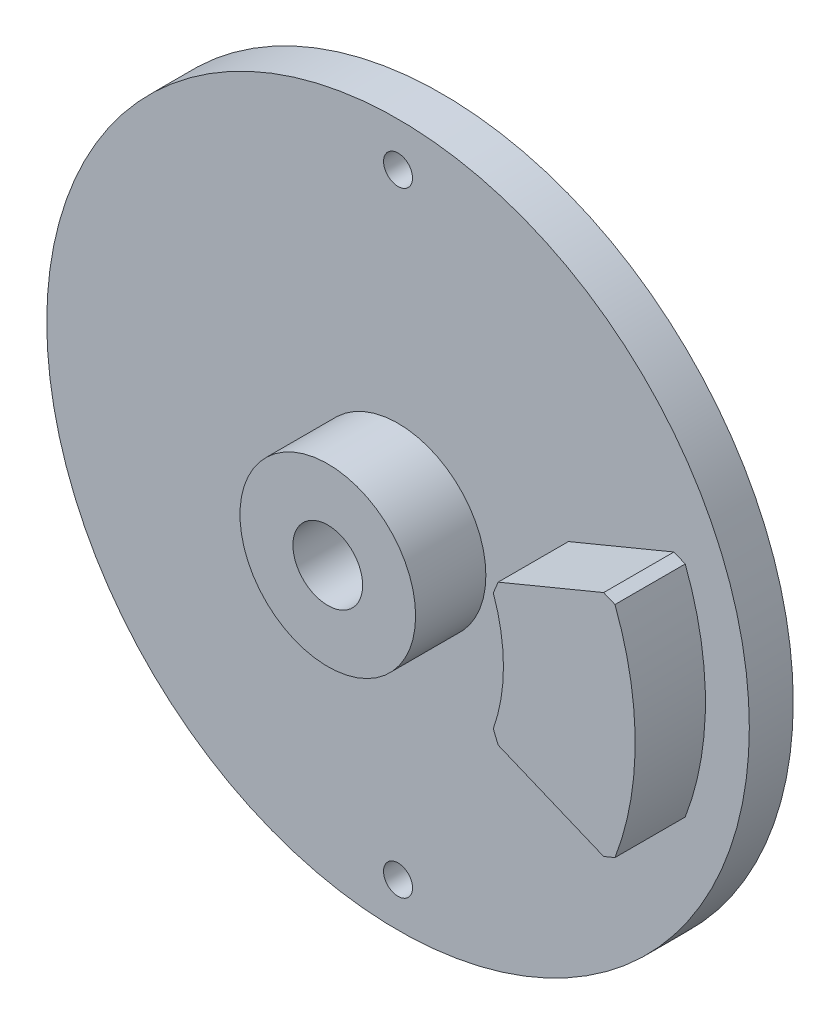
ISO-10303-21;
HEADER;
FILE_DESCRIPTION(('STEP AP214'),'2;1');
FILE_NAME('part.step','',(''),(''),'','','');
FILE_SCHEMA(('AUTOMOTIVE_DESIGN { 1 0 10303 214 1 1 1 1 }'));
ENDSEC;
DATA;
#1=APPLICATION_CONTEXT('core data for automotive mechanical design processes');
#2=APPLICATION_PROTOCOL_DEFINITION('international standard','automotive_design',2000,#1);
#3=PRODUCT_CONTEXT('',#1,'mechanical');
#4=PRODUCT('Part','Part','',(#3));
#5=PRODUCT_RELATED_PRODUCT_CATEGORY('part','',(#4));
#6=PRODUCT_DEFINITION_FORMATION('','',#4);
#7=PRODUCT_DEFINITION_CONTEXT('part definition',#1,'design');
#8=PRODUCT_DEFINITION('design','',#6,#7);
#9=PRODUCT_DEFINITION_SHAPE('','',#8);
#10=(LENGTH_UNIT() NAMED_UNIT(*) SI_UNIT(.MILLI.,.METRE.));
#11=(NAMED_UNIT(*) PLANE_ANGLE_UNIT() SI_UNIT($,.RADIAN.));
#12=(NAMED_UNIT(*) SI_UNIT($,.STERADIAN.) SOLID_ANGLE_UNIT());
#13=UNCERTAINTY_MEASURE_WITH_UNIT(LENGTH_MEASURE(1.E-05),#10,'distance_accuracy_value','');
#14=(GEOMETRIC_REPRESENTATION_CONTEXT(3) GLOBAL_UNCERTAINTY_ASSIGNED_CONTEXT((#13)) GLOBAL_UNIT_ASSIGNED_CONTEXT((#10,
#11,#12)) REPRESENTATION_CONTEXT('',''));
#15=CARTESIAN_POINT('',(0.,0.,0.));
#16=DIRECTION('',(0.,0.,1.));
#17=DIRECTION('',(1.,0.,0.));
#18=AXIS2_PLACEMENT_3D('',#15,#16,#17);
#19=CARTESIAN_POINT('',(0.,0.,5.));
#20=DIRECTION('',(0.,0.,1.));
#21=DIRECTION('',(1.,0.,0.));
#22=AXIS2_PLACEMENT_3D('',#19,#20,#21);
#23=PLANE('',#22);
#24=CARTESIAN_POINT('',(0.,0.,5.));
#25=DIRECTION('',(0.,0.,1.));
#26=DIRECTION('',(1.,0.,0.));
#27=AXIS2_PLACEMENT_3D('',#24,#25,#26);
#28=CIRCLE('',#27,10.);
#29=CARTESIAN_POINT('',(10.,0.,5.));
#30=VERTEX_POINT('',#29);
#31=EDGE_CURVE('E179',#30,#30,#28,.T.);
#32=ORIENTED_EDGE('',*,*,#31,.F.);
#33=EDGE_LOOP('',(#32));
#34=FACE_BOUND('',#33,.T.);
#35=CARTESIAN_POINT('',(0.,-35.,5.));
#36=DIRECTION('',(0.,0.,1.));
#37=DIRECTION('',(1.,0.,0.));
#38=AXIS2_PLACEMENT_3D('',#35,#36,#37);
#39=CIRCLE('',#38,1.65);
#40=CARTESIAN_POINT('',(1.65000000000001,-35.,5.));
#41=VERTEX_POINT('',#40);
#42=EDGE_CURVE('E190',#41,#41,#39,.T.);
#43=ORIENTED_EDGE('',*,*,#42,.F.);
#44=EDGE_LOOP('',(#43));
#45=FACE_BOUND('',#44,.T.);
#46=CARTESIAN_POINT('',(0.,35.,5.));
#47=DIRECTION('',(0.,0.,1.));
#48=DIRECTION('',(1.,0.,0.));
#49=AXIS2_PLACEMENT_3D('',#46,#47,#48);
#50=CIRCLE('',#49,1.65);
#51=CARTESIAN_POINT('',(1.65000000000001,35.,5.));
#52=VERTEX_POINT('',#51);
#53=EDGE_CURVE('E198',#52,#52,#50,.T.);
#54=ORIENTED_EDGE('',*,*,#53,.F.);
#55=EDGE_LOOP('',(#54));
#56=FACE_BOUND('',#55,.T.);
#57=CARTESIAN_POINT('',(0.,0.,5.));
#58=DIRECTION('',(0.,0.,1.));
#59=DIRECTION('',(1.,0.,0.));
#60=AXIS2_PLACEMENT_3D('',#57,#58,#59);
#61=CIRCLE('',#60,40.);
#62=CARTESIAN_POINT('',(40.,0.,5.));
#63=VERTEX_POINT('',#62);
#64=EDGE_CURVE('E120',#63,#63,#61,.T.);
#65=ORIENTED_EDGE('',*,*,#64,.T.);
#66=EDGE_LOOP('',(#65));
#67=FACE_BOUND('',#66,.T.);
#68=CARTESIAN_POINT('',(0.,0.,5.));
#69=DIRECTION('',(0.,0.,1.));
#70=DIRECTION('',(1.,0.,0.));
#71=AXIS2_PLACEMENT_3D('',#68,#69,#70);
#72=CIRCLE('',#71,20.);
#73=CARTESIAN_POINT('',(18.846012299358,6.69535812428628,5.));
#74=VERTEX_POINT('',#73);
#75=CARTESIAN_POINT('',(18.846012299358,-6.69535812428629,5.));
#76=VERTEX_POINT('',#75);
#77=EDGE_CURVE('E154',#74,#76,#72,.F.);
#78=ORIENTED_EDGE('',*,*,#77,.F.);
#79=DIRECTION('',(-0.382683432365087,-0.923879532511288,0.));
#80=VECTOR('',#79,1.);
#81=CARTESIAN_POINT('',(18.846012299358,6.69535812428629,5.));
#82=LINE('',#81,#80);
#83=CARTESIAN_POINT('',(19.401470182737,8.0363520796669,5.));
#84=VERTEX_POINT('',#83);
#85=EDGE_CURVE('E50',#74,#84,#82,.F.);
#86=ORIENTED_EDGE('',*,*,#85,.T.);
#87=DIRECTION('',(-0.923879532511287,-0.382683432365091,0.));
#88=VECTOR('',#87,1.);
#89=CARTESIAN_POINT('',(0.,0.,5.));
#90=LINE('',#89,#88);
#91=CARTESIAN_POINT('',(31.4119041053837,13.0112367004131,5.));
#92=VERTEX_POINT('',#91);
#93=EDGE_CURVE('E106',#92,#84,#90,.T.);
#94=ORIENTED_EDGE('',*,*,#93,.F.);
#95=DIRECTION('',(-0.923879532511286,0.382683432365093,0.));
#96=VECTOR('',#95,1.);
#97=CARTESIAN_POINT('',(31.4119041053837,13.0112367004131,5.));
#98=LINE('',#97,#96);
#99=CARTESIAN_POINT('',(32.7003133559627,12.4775601149363,5.));
#100=VERTEX_POINT('',#99);
#101=EDGE_CURVE('E11',#92,#100,#98,.F.);
#102=ORIENTED_EDGE('',*,*,#101,.T.);
#103=CARTESIAN_POINT('',(0.,0.,5.));
#104=DIRECTION('',(0.,0.,1.));
#105=DIRECTION('',(1.,0.,0.));
#106=AXIS2_PLACEMENT_3D('',#103,#104,#105);
#107=CIRCLE('',#106,35.);
#108=CARTESIAN_POINT('',(32.7003133559627,-12.4775601149363,5.));
#109=VERTEX_POINT('',#108);
#110=EDGE_CURVE('E105',#100,#109,#107,.F.);
#111=ORIENTED_EDGE('',*,*,#110,.T.);
#112=DIRECTION('',(0.923879532511286,0.382683432365093,0.));
#113=VECTOR('',#112,1.);
#114=CARTESIAN_POINT('',(32.7003133559627,-12.4775601149363,5.));
#115=LINE('',#114,#113);
#116=CARTESIAN_POINT('',(31.4119041053837,-13.0112367004131,5.));
#117=VERTEX_POINT('',#116);
#118=EDGE_CURVE('E149',#109,#117,#115,.F.);
#119=ORIENTED_EDGE('',*,*,#118,.T.);
#120=DIRECTION('',(-0.923879532511287,0.382683432365091,0.));
#121=VECTOR('',#120,1.);
#122=CARTESIAN_POINT('',(0.,0.,5.));
#123=LINE('',#122,#121);
#124=CARTESIAN_POINT('',(19.401470182737,-8.03635207966691,5.));
#125=VERTEX_POINT('',#124);
#126=EDGE_CURVE('E116',#117,#125,#123,.T.);
#127=ORIENTED_EDGE('',*,*,#126,.T.);
#128=DIRECTION('',(0.382683432365091,-0.923879532511286,0.));
#129=VECTOR('',#128,1.);
#130=CARTESIAN_POINT('',(19.401470182737,-8.0363520796669,5.));
#131=LINE('',#130,#129);
#132=EDGE_CURVE('E151',#125,#76,#131,.F.);
#133=ORIENTED_EDGE('',*,*,#132,.T.);
#134=EDGE_LOOP('',(#78,#86,#94,#102,#111,#119,#127,#133));
#135=FACE_BOUND('',#134,.T.);
#136=ADVANCED_FACE('F41',(#34,#45,#56,#67,#135),#23,.T.);
#137=CARTESIAN_POINT('',(0.,0.,5.));
#138=DIRECTION('',(0.,0.,-1.));
#139=DIRECTION('',(-1.,0.,0.));
#140=AXIS2_PLACEMENT_3D('',#137,#138,#139);
#141=CYLINDRICAL_SURFACE('',#140,40.);
#142=ORIENTED_EDGE('',*,*,#64,.F.);
#143=EDGE_LOOP('',(#142));
#144=FACE_BOUND('',#143,.T.);
#145=CARTESIAN_POINT('',(0.,0.,0.));
#146=DIRECTION('',(0.,0.,1.));
#147=DIRECTION('',(1.,0.,0.));
#148=AXIS2_PLACEMENT_3D('',#145,#146,#147);
#149=CIRCLE('',#148,40.);
#150=CARTESIAN_POINT('',(40.,0.,0.));
#151=VERTEX_POINT('',#150);
#152=EDGE_CURVE('E125',#151,#151,#149,.T.);
#153=ORIENTED_EDGE('',*,*,#152,.T.);
#154=EDGE_LOOP('',(#153));
#155=FACE_BOUND('',#154,.T.);
#156=ADVANCED_FACE('F208',(#144,#155),#141,.T.);
#157=CARTESIAN_POINT('',(0.,0.,0.));
#158=DIRECTION('',(0.,0.,1.));
#159=DIRECTION('',(1.,0.,0.));
#160=AXIS2_PLACEMENT_3D('',#157,#158,#159);
#161=PLANE('',#160);
#162=CARTESIAN_POINT('',(0.,0.,0.));
#163=DIRECTION('',(0.,0.,-1.));
#164=DIRECTION('',(-1.,0.,0.));
#165=AXIS2_PLACEMENT_3D('',#162,#163,#164);
#166=CIRCLE('',#165,3.96875);
#167=CARTESIAN_POINT('',(-3.96875,0.,0.));
#168=VERTEX_POINT('',#167);
#169=EDGE_CURVE('E270',#168,#168,#166,.T.);
#170=ORIENTED_EDGE('',*,*,#169,.F.);
#171=EDGE_LOOP('',(#170));
#172=FACE_BOUND('',#171,.T.);
#173=CARTESIAN_POINT('',(0.,-35.,0.));
#174=DIRECTION('',(0.,0.,1.));
#175=DIRECTION('',(1.,0.,0.));
#176=AXIS2_PLACEMENT_3D('',#173,#174,#175);
#177=CIRCLE('',#176,1.65);
#178=CARTESIAN_POINT('',(1.65000000000001,-35.,0.));
#179=VERTEX_POINT('',#178);
#180=EDGE_CURVE('E195',#179,#179,#177,.T.);
#181=ORIENTED_EDGE('',*,*,#180,.T.);
#182=EDGE_LOOP('',(#181));
#183=FACE_BOUND('',#182,.T.);
#184=CARTESIAN_POINT('',(0.,35.,0.));
#185=DIRECTION('',(0.,0.,1.));
#186=DIRECTION('',(1.,0.,0.));
#187=AXIS2_PLACEMENT_3D('',#184,#185,#186);
#188=CIRCLE('',#187,1.65);
#189=CARTESIAN_POINT('',(1.65000000000001,35.,0.));
#190=VERTEX_POINT('',#189);
#191=EDGE_CURVE('E201',#190,#190,#188,.T.);
#192=ORIENTED_EDGE('',*,*,#191,.T.);
#193=EDGE_LOOP('',(#192));
#194=FACE_BOUND('',#193,.T.);
#195=ORIENTED_EDGE('',*,*,#152,.F.);
#196=EDGE_LOOP('',(#195));
#197=FACE_BOUND('',#196,.T.);
#198=ADVANCED_FACE('F210',(#172,#183,#194,#197),#161,.F.);
#199=CARTESIAN_POINT('',(0.,35.,5.));
#200=DIRECTION('',(0.,0.,1.));
#201=DIRECTION('',(1.,0.,0.));
#202=AXIS2_PLACEMENT_3D('',#199,#200,#201);
#203=CYLINDRICAL_SURFACE('',#202,1.65);
#204=ORIENTED_EDGE('',*,*,#191,.F.);
#205=EDGE_LOOP('',(#204));
#206=FACE_BOUND('',#205,.T.);
#207=ORIENTED_EDGE('',*,*,#53,.T.);
#208=EDGE_LOOP('',(#207));
#209=FACE_BOUND('',#208,.T.);
#210=ADVANCED_FACE('F212',(#206,#209),#203,.F.);
#211=CARTESIAN_POINT('',(0.,-35.,5.));
#212=DIRECTION('',(0.,0.,1.));
#213=DIRECTION('',(1.,0.,0.));
#214=AXIS2_PLACEMENT_3D('',#211,#212,#213);
#215=CYLINDRICAL_SURFACE('',#214,1.65);
#216=ORIENTED_EDGE('',*,*,#180,.F.);
#217=EDGE_LOOP('',(#216));
#218=FACE_BOUND('',#217,.T.);
#219=ORIENTED_EDGE('',*,*,#42,.T.);
#220=EDGE_LOOP('',(#219));
#221=FACE_BOUND('',#220,.T.);
#222=ADVANCED_FACE('F219',(#218,#221),#215,.F.);
#223=CARTESIAN_POINT('',(0.,0.,13.));
#224=DIRECTION('',(0.,0.,-1.));
#225=DIRECTION('',(-1.,0.,0.));
#226=AXIS2_PLACEMENT_3D('',#223,#224,#225);
#227=CYLINDRICAL_SURFACE('',#226,10.);
#228=CARTESIAN_POINT('',(0.,0.,13.));
#229=DIRECTION('',(0.,0.,1.));
#230=DIRECTION('',(1.,0.,0.));
#231=AXIS2_PLACEMENT_3D('',#228,#229,#230);
#232=CIRCLE('',#231,10.);
#233=CARTESIAN_POINT('',(10.,0.,13.));
#234=VERTEX_POINT('',#233);
#235=EDGE_CURVE('E187',#234,#234,#232,.T.);
#236=ORIENTED_EDGE('',*,*,#235,.F.);
#237=EDGE_LOOP('',(#236));
#238=FACE_BOUND('',#237,.T.);
#239=ORIENTED_EDGE('',*,*,#31,.T.);
#240=EDGE_LOOP('',(#239));
#241=FACE_BOUND('',#240,.T.);
#242=ADVANCED_FACE('F238',(#238,#241),#227,.T.);
#243=CARTESIAN_POINT('',(0.,0.,13.));
#244=DIRECTION('',(0.,0.,1.));
#245=DIRECTION('',(1.,0.,0.));
#246=AXIS2_PLACEMENT_3D('',#243,#244,#245);
#247=PLANE('',#246);
#248=CARTESIAN_POINT('',(0.,0.,13.));
#249=DIRECTION('',(0.,0.,1.));
#250=DIRECTION('',(1.,0.,0.));
#251=AXIS2_PLACEMENT_3D('',#248,#249,#250);
#252=CIRCLE('',#251,3.96875);
#253=CARTESIAN_POINT('',(3.96875,0.,13.));
#254=VERTEX_POINT('',#253);
#255=EDGE_CURVE('E184',#254,#254,#252,.T.);
#256=ORIENTED_EDGE('',*,*,#255,.F.);
#257=EDGE_LOOP('',(#256));
#258=FACE_BOUND('',#257,.T.);
#259=ORIENTED_EDGE('',*,*,#235,.T.);
#260=EDGE_LOOP('',(#259));
#261=FACE_BOUND('',#260,.T.);
#262=ADVANCED_FACE('F242',(#258,#261),#247,.T.);
#263=CARTESIAN_POINT('',(0.,0.,13.));
#264=DIRECTION('',(0.382683432365091,-0.923879532511287,0.));
#265=DIRECTION('',(0.923879532511287,0.382683432365091,0.));
#266=AXIS2_PLACEMENT_3D('',#263,#264,#265);
#267=PLANE('',#266);
#268=ORIENTED_EDGE('',*,*,#93,.T.);
#269=DIRECTION('',(0.,0.,1.));
#270=VECTOR('',#269,1.);
#271=CARTESIAN_POINT('',(19.401470182737,8.0363520796669,13.));
#272=LINE('',#271,#270);
#273=CARTESIAN_POINT('',(19.401470182737,8.0363520796669,13.));
#274=VERTEX_POINT('',#273);
#275=EDGE_CURVE('E147',#84,#274,#272,.T.);
#276=ORIENTED_EDGE('',*,*,#275,.T.);
#277=DIRECTION('',(-0.923879532511287,-0.382683432365091,0.));
#278=VECTOR('',#277,1.);
#279=CARTESIAN_POINT('',(0.,0.,13.));
#280=LINE('',#279,#278);
#281=CARTESIAN_POINT('',(31.4119041053837,13.0112367004131,13.));
#282=VERTEX_POINT('',#281);
#283=EDGE_CURVE('E115',#282,#274,#280,.T.);
#284=ORIENTED_EDGE('',*,*,#283,.F.);
#285=DIRECTION('',(0.,0.,-1.));
#286=VECTOR('',#285,1.);
#287=CARTESIAN_POINT('',(31.4119041053837,13.0112367004131,5.));
#288=LINE('',#287,#286);
#289=EDGE_CURVE('E145',#282,#92,#288,.T.);
#290=ORIENTED_EDGE('',*,*,#289,.T.);
#291=EDGE_LOOP('',(#268,#276,#284,#290));
#292=FACE_BOUND('',#291,.T.);
#293=ADVANCED_FACE('F246',(#292),#267,.F.);
#294=CARTESIAN_POINT('',(0.,0.,13.));
#295=DIRECTION('',(0.,0.,-1.));
#296=DIRECTION('',(-1.,0.,0.));
#297=AXIS2_PLACEMENT_3D('',#294,#295,#296);
#298=CYLINDRICAL_SURFACE('',#297,20.);
#299=ORIENTED_EDGE('',*,*,#77,.T.);
#300=DIRECTION('',(0.,0.,-1.));
#301=VECTOR('',#300,1.);
#302=CARTESIAN_POINT('',(18.846012299358,-6.69535812428629,13.));
#303=LINE('',#302,#301);
#304=CARTESIAN_POINT('',(18.846012299358,-6.69535812428629,13.));
#305=VERTEX_POINT('',#304);
#306=EDGE_CURVE('E143',#76,#305,#303,.F.);
#307=ORIENTED_EDGE('',*,*,#306,.T.);
#308=CARTESIAN_POINT('',(0.,0.,13.));
#309=DIRECTION('',(0.,0.,1.));
#310=DIRECTION('',(1.,0.,0.));
#311=AXIS2_PLACEMENT_3D('',#308,#309,#310);
#312=CIRCLE('',#311,20.);
#313=CARTESIAN_POINT('',(18.846012299358,6.69535812428628,13.));
#314=VERTEX_POINT('',#313);
#315=EDGE_CURVE('E173',#314,#305,#312,.F.);
#316=ORIENTED_EDGE('',*,*,#315,.F.);
#317=DIRECTION('',(0.,0.,-1.));
#318=VECTOR('',#317,1.);
#319=CARTESIAN_POINT('',(18.846012299358,6.69535812428628,13.));
#320=LINE('',#319,#318);
#321=EDGE_CURVE('E140',#314,#74,#320,.T.);
#322=ORIENTED_EDGE('',*,*,#321,.T.);
#323=EDGE_LOOP('',(#299,#307,#316,#322));
#324=FACE_BOUND('',#323,.T.);
#325=ADVANCED_FACE('F160',(#324),#298,.F.);
#326=CARTESIAN_POINT('',(0.,0.,13.));
#327=DIRECTION('',(-0.382683432365091,-0.923879532511287,0.));
#328=DIRECTION('',(0.923879532511287,-0.382683432365091,0.));
#329=AXIS2_PLACEMENT_3D('',#326,#327,#328);
#330=PLANE('',#329);
#331=ORIENTED_EDGE('',*,*,#126,.F.);
#332=DIRECTION('',(0.,0.,1.));
#333=VECTOR('',#332,1.);
#334=CARTESIAN_POINT('',(31.4119041053837,-13.0112367004131,13.));
#335=LINE('',#334,#333);
#336=CARTESIAN_POINT('',(31.4119041053837,-13.0112367004131,13.));
#337=VERTEX_POINT('',#336);
#338=EDGE_CURVE('E131',#117,#337,#335,.T.);
#339=ORIENTED_EDGE('',*,*,#338,.T.);
#340=DIRECTION('',(-0.923879532511287,0.382683432365091,0.));
#341=VECTOR('',#340,1.);
#342=CARTESIAN_POINT('',(0.,0.,13.));
#343=LINE('',#342,#341);
#344=CARTESIAN_POINT('',(19.401470182737,-8.03635207966691,13.));
#345=VERTEX_POINT('',#344);
#346=EDGE_CURVE('E171',#337,#345,#343,.T.);
#347=ORIENTED_EDGE('',*,*,#346,.T.);
#348=DIRECTION('',(0.,0.,-1.));
#349=VECTOR('',#348,1.);
#350=CARTESIAN_POINT('',(19.401470182737,-8.03635207966691,5.));
#351=LINE('',#350,#349);
#352=EDGE_CURVE('E122',#345,#125,#351,.T.);
#353=ORIENTED_EDGE('',*,*,#352,.T.);
#354=EDGE_LOOP('',(#331,#339,#347,#353));
#355=FACE_BOUND('',#354,.T.);
#356=ADVANCED_FACE('F175',(#355),#330,.T.);
#357=CARTESIAN_POINT('',(0.,0.,13.));
#358=DIRECTION('',(0.,0.,-1.));
#359=DIRECTION('',(-1.,0.,0.));
#360=AXIS2_PLACEMENT_3D('',#357,#358,#359);
#361=CYLINDRICAL_SURFACE('',#360,35.);
#362=CARTESIAN_POINT('',(0.,0.,13.));
#363=DIRECTION('',(0.,0.,1.));
#364=DIRECTION('',(1.,0.,0.));
#365=AXIS2_PLACEMENT_3D('',#362,#363,#364);
#366=CIRCLE('',#365,35.);
#367=CARTESIAN_POINT('',(32.7003133559627,12.4775601149363,13.));
#368=VERTEX_POINT('',#367);
#369=CARTESIAN_POINT('',(32.7003133559627,-12.4775601149363,13.));
#370=VERTEX_POINT('',#369);
#371=EDGE_CURVE('E177',#368,#370,#366,.F.);
#372=ORIENTED_EDGE('',*,*,#371,.T.);
#373=DIRECTION('',(0.,0.,-1.));
#374=VECTOR('',#373,1.);
#375=CARTESIAN_POINT('',(32.7003133559627,-12.4775601149363,13.));
#376=LINE('',#375,#374);
#377=EDGE_CURVE('E114',#370,#109,#376,.T.);
#378=ORIENTED_EDGE('',*,*,#377,.T.);
#379=ORIENTED_EDGE('',*,*,#110,.F.);
#380=DIRECTION('',(0.,0.,-1.));
#381=VECTOR('',#380,1.);
#382=CARTESIAN_POINT('',(32.7003133559627,12.4775601149363,13.));
#383=LINE('',#382,#381);
#384=EDGE_CURVE('E111',#100,#368,#383,.F.);
#385=ORIENTED_EDGE('',*,*,#384,.T.);
#386=EDGE_LOOP('',(#372,#378,#379,#385));
#387=FACE_BOUND('',#386,.T.);
#388=ADVANCED_FACE('F110',(#387),#361,.T.);
#389=CARTESIAN_POINT('',(0.,0.,13.));
#390=DIRECTION('',(0.,0.,1.));
#391=DIRECTION('',(1.,0.,0.));
#392=AXIS2_PLACEMENT_3D('',#389,#390,#391);
#393=PLANE('',#392);
#394=ORIENTED_EDGE('',*,*,#346,.F.);
#395=DIRECTION('',(-0.923879532511286,-0.382683432365093,0.));
#396=VECTOR('',#395,1.);
#397=CARTESIAN_POINT('',(9.20033370248546,-22.2115704028985,13.));
#398=LINE('',#397,#396);
#399=EDGE_CURVE('E138',#337,#370,#398,.F.);
#400=ORIENTED_EDGE('',*,*,#399,.T.);
#401=ORIENTED_EDGE('',*,*,#371,.F.);
#402=DIRECTION('',(0.923879532511286,-0.382683432365093,0.));
#403=VECTOR('',#402,1.);
#404=CARTESIAN_POINT('',(9.20033370248546,22.2115704028985,13.));
#405=LINE('',#404,#403);
#406=EDGE_CURVE('E119',#368,#282,#405,.F.);
#407=ORIENTED_EDGE('',*,*,#406,.T.);
#408=ORIENTED_EDGE('',*,*,#283,.T.);
#409=DIRECTION('',(0.382683432365087,0.923879532511288,0.));
#410=VECTOR('',#409,1.);
#411=CARTESIAN_POINT('',(13.718911131202,-5.68255905153504,13.));
#412=LINE('',#411,#410);
#413=EDGE_CURVE('E134',#274,#314,#412,.F.);
#414=ORIENTED_EDGE('',*,*,#413,.T.);
#415=ORIENTED_EDGE('',*,*,#315,.T.);
#416=DIRECTION('',(-0.382683432365091,0.923879532511286,0.));
#417=VECTOR('',#416,1.);
#418=CARTESIAN_POINT('',(13.7189111312019,5.68255905153508,13.));
#419=LINE('',#418,#417);
#420=EDGE_CURVE('E136',#305,#345,#419,.F.);
#421=ORIENTED_EDGE('',*,*,#420,.T.);
#422=EDGE_LOOP('',(#394,#400,#401,#407,#408,#414,#415,#421));
#423=FACE_BOUND('',#422,.T.);
#424=ADVANCED_FACE('F170',(#423),#393,.T.);
#425=CARTESIAN_POINT('',(0.,0.,0.));
#426=DIRECTION('',(0.,0.,-1.));
#427=DIRECTION('',(-1.,0.,0.));
#428=AXIS2_PLACEMENT_3D('',#425,#426,#427);
#429=CYLINDRICAL_SURFACE('',#428,3.96875);
#430=ORIENTED_EDGE('',*,*,#169,.T.);
#431=EDGE_LOOP('',(#430));
#432=FACE_BOUND('',#431,.T.);
#433=ORIENTED_EDGE('',*,*,#255,.T.);
#434=EDGE_LOOP('',(#433));
#435=FACE_BOUND('',#434,.T.);
#436=ADVANCED_FACE('F258',(#432,#435),#429,.F.);
#437=CARTESIAN_POINT('',(32.7003133559627,-12.4775601149363,13.));
#438=DIRECTION('',(-0.382683432365093,0.923879532511286,0.));
#439=DIRECTION('',(0.,0.,-1.));
#440=AXIS2_PLACEMENT_3D('',#437,#438,#439);
#441=PLANE('',#440);
#442=ORIENTED_EDGE('',*,*,#399,.F.);
#443=ORIENTED_EDGE('',*,*,#338,.F.);
#444=ORIENTED_EDGE('',*,*,#118,.F.);
#445=ORIENTED_EDGE('',*,*,#377,.F.);
#446=EDGE_LOOP('',(#442,#443,#444,#445));
#447=FACE_BOUND('',#446,.T.);
#448=ADVANCED_FACE('F260',(#447),#441,.F.);
#449=CARTESIAN_POINT('',(19.401470182737,-8.0363520796669,13.));
#450=DIRECTION('',(0.923879532511286,0.382683432365091,0.));
#451=DIRECTION('',(0.,0.,-1.));
#452=AXIS2_PLACEMENT_3D('',#449,#450,#451);
#453=PLANE('',#452);
#454=ORIENTED_EDGE('',*,*,#420,.F.);
#455=ORIENTED_EDGE('',*,*,#306,.F.);
#456=ORIENTED_EDGE('',*,*,#132,.F.);
#457=ORIENTED_EDGE('',*,*,#352,.F.);
#458=EDGE_LOOP('',(#454,#455,#456,#457));
#459=FACE_BOUND('',#458,.T.);
#460=ADVANCED_FACE('F166',(#459),#453,.F.);
#461=CARTESIAN_POINT('',(18.846012299358,6.69535812428629,13.));
#462=DIRECTION('',(0.923879532511288,-0.382683432365087,0.));
#463=DIRECTION('',(0.,0.,-1.));
#464=AXIS2_PLACEMENT_3D('',#461,#462,#463);
#465=PLANE('',#464);
#466=ORIENTED_EDGE('',*,*,#413,.F.);
#467=ORIENTED_EDGE('',*,*,#275,.F.);
#468=ORIENTED_EDGE('',*,*,#85,.F.);
#469=ORIENTED_EDGE('',*,*,#321,.F.);
#470=EDGE_LOOP('',(#466,#467,#468,#469));
#471=FACE_BOUND('',#470,.T.);
#472=ADVANCED_FACE('F280',(#471),#465,.F.);
#473=CARTESIAN_POINT('',(31.4119041053837,13.0112367004131,13.));
#474=DIRECTION('',(-0.382683432365093,-0.923879532511286,0.));
#475=DIRECTION('',(0.,0.,-1.));
#476=AXIS2_PLACEMENT_3D('',#473,#474,#475);
#477=PLANE('',#476);
#478=ORIENTED_EDGE('',*,*,#406,.F.);
#479=ORIENTED_EDGE('',*,*,#384,.F.);
#480=ORIENTED_EDGE('',*,*,#101,.F.);
#481=ORIENTED_EDGE('',*,*,#289,.F.);
#482=EDGE_LOOP('',(#478,#479,#480,#481));
#483=FACE_BOUND('',#482,.T.);
#484=ADVANCED_FACE('F44',(#483),#477,.F.);
#485=CLOSED_SHELL('',(#136,#156,#198,#210,#222,#242,#262,#293,#325,#356,#388,#424,#436,#448,
#460,#472,#484));
#486=MANIFOLD_SOLID_BREP('B2',#485);
#487=ADVANCED_BREP_SHAPE_REPRESENTATION('',(#18,#486),#14);
#488=SHAPE_DEFINITION_REPRESENTATION(#9,#487);
ENDSEC;
END-ISO-10303-21;
